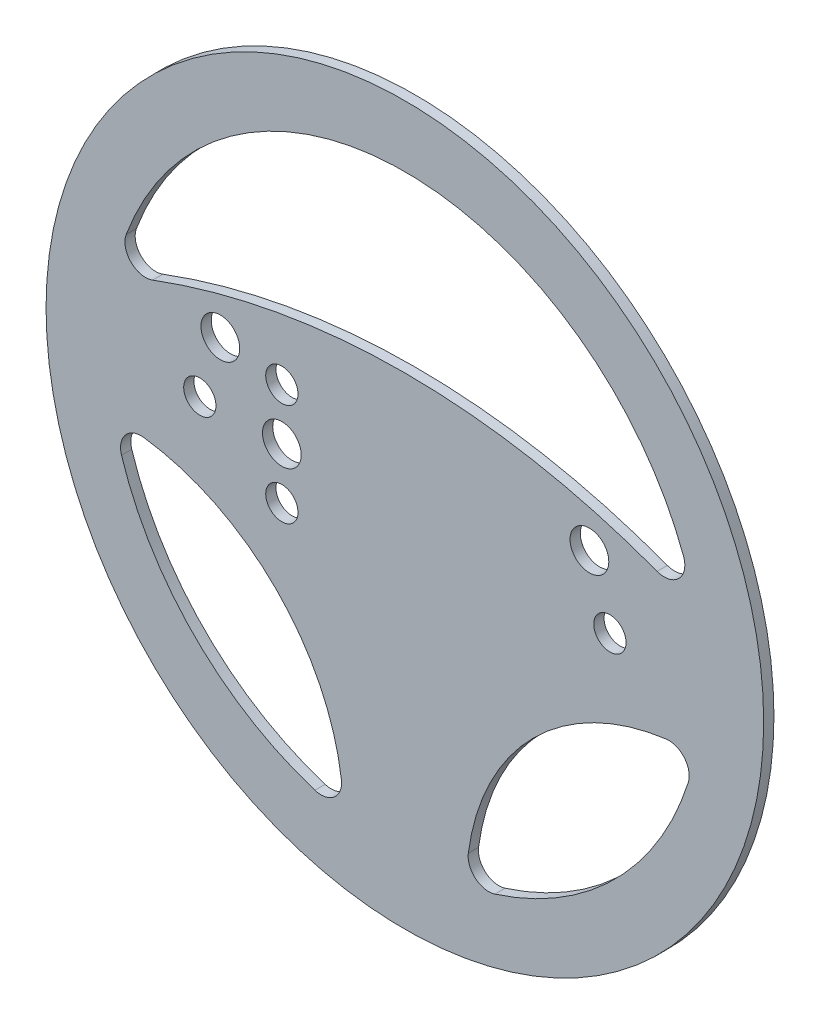
ISO-10303-21;
HEADER;
FILE_DESCRIPTION(('STEP AP214'),'2;1');
FILE_NAME('part.step','',(''),(''),'','','');
FILE_SCHEMA(('AUTOMOTIVE_DESIGN { 1 0 10303 214 1 1 1 1 }'));
ENDSEC;
DATA;
#1=APPLICATION_CONTEXT('core data for automotive mechanical design processes');
#2=APPLICATION_PROTOCOL_DEFINITION('international standard','automotive_design',2000,#1);
#3=PRODUCT_CONTEXT('',#1,'mechanical');
#4=PRODUCT('Part','Part','',(#3));
#5=PRODUCT_RELATED_PRODUCT_CATEGORY('part','',(#4));
#6=PRODUCT_DEFINITION_FORMATION('','',#4);
#7=PRODUCT_DEFINITION_CONTEXT('part definition',#1,'design');
#8=PRODUCT_DEFINITION('design','',#6,#7);
#9=PRODUCT_DEFINITION_SHAPE('','',#8);
#10=(LENGTH_UNIT() NAMED_UNIT(*) SI_UNIT(.MILLI.,.METRE.));
#11=(NAMED_UNIT(*) PLANE_ANGLE_UNIT() SI_UNIT($,.RADIAN.));
#12=(NAMED_UNIT(*) SI_UNIT($,.STERADIAN.) SOLID_ANGLE_UNIT());
#13=UNCERTAINTY_MEASURE_WITH_UNIT(LENGTH_MEASURE(1.E-05),#10,'distance_accuracy_value','');
#14=(GEOMETRIC_REPRESENTATION_CONTEXT(3) GLOBAL_UNCERTAINTY_ASSIGNED_CONTEXT((#13)) GLOBAL_UNIT_ASSIGNED_CONTEXT((#10,
#11,#12)) REPRESENTATION_CONTEXT('',''));
#15=CARTESIAN_POINT('',(0.,0.,0.));
#16=DIRECTION('',(0.,0.,1.));
#17=DIRECTION('',(1.,0.,0.));
#18=AXIS2_PLACEMENT_3D('',#15,#16,#17);
#19=CARTESIAN_POINT('',(0.,0.,3.175));
#20=DIRECTION('',(0.,0.,1.));
#21=DIRECTION('',(1.,0.,0.));
#22=AXIS2_PLACEMENT_3D('',#19,#20,#21);
#23=PLANE('',#22);
#24=CARTESIAN_POINT('',(-38.1,0.,3.175));
#25=DIRECTION('',(0.,0.,1.));
#26=DIRECTION('',(1.,0.,0.));
#27=AXIS2_PLACEMENT_3D('',#24,#25,#26);
#28=CIRCLE('',#27,5.999999938);
#29=CARTESIAN_POINT('',(-32.100000062,0.,3.175));
#30=VERTEX_POINT('',#29);
#31=EDGE_CURVE('E417',#30,#30,#28,.F.);
#32=ORIENTED_EDGE('',*,*,#31,.T.);
#33=EDGE_LOOP('',(#32));
#34=FACE_BOUND('',#33,.T.);
#35=CARTESIAN_POINT('',(-63.5,0.,3.175));
#36=DIRECTION('',(0.,0.,1.));
#37=DIRECTION('',(1.,0.,0.));
#38=AXIS2_PLACEMENT_3D('',#35,#36,#37);
#39=CIRCLE('',#38,5.000000033);
#40=CARTESIAN_POINT('',(-58.499999967,0.,3.175));
#41=VERTEX_POINT('',#40);
#42=EDGE_CURVE('E424',#41,#41,#39,.F.);
#43=ORIENTED_EDGE('',*,*,#42,.T.);
#44=EDGE_LOOP('',(#43));
#45=FACE_BOUND('',#44,.T.);
#46=CARTESIAN_POINT('',(-57.15,19.05,3.175));
#47=DIRECTION('',(0.,0.,1.));
#48=DIRECTION('',(1.,0.,0.));
#49=AXIS2_PLACEMENT_3D('',#46,#47,#48);
#50=CIRCLE('',#49,5.99999993799999);
#51=CARTESIAN_POINT('',(-51.150000062,19.05,3.175));
#52=VERTEX_POINT('',#51);
#53=EDGE_CURVE('E435',#52,#52,#50,.F.);
#54=ORIENTED_EDGE('',*,*,#53,.T.);
#55=EDGE_LOOP('',(#54));
#56=FACE_BOUND('',#55,.T.);
#57=CARTESIAN_POINT('',(63.5,0.,3.175));
#58=DIRECTION('',(0.,0.,1.));
#59=DIRECTION('',(1.,0.,0.));
#60=AXIS2_PLACEMENT_3D('',#57,#58,#59);
#61=CIRCLE('',#60,5.000000033);
#62=CARTESIAN_POINT('',(68.500000033,0.,3.175));
#63=VERTEX_POINT('',#62);
#64=EDGE_CURVE('E434',#63,#63,#61,.F.);
#65=ORIENTED_EDGE('',*,*,#64,.T.);
#66=EDGE_LOOP('',(#65));
#67=FACE_BOUND('',#66,.T.);
#68=CARTESIAN_POINT('',(-38.1,15.875,3.175));
#69=DIRECTION('',(0.,0.,1.));
#70=DIRECTION('',(1.,0.,0.));
#71=AXIS2_PLACEMENT_3D('',#68,#69,#70);
#72=CIRCLE('',#71,5.000000033);
#73=CARTESIAN_POINT('',(-33.099999967,15.875,3.175));
#74=VERTEX_POINT('',#73);
#75=EDGE_CURVE('E426',#74,#74,#72,.F.);
#76=ORIENTED_EDGE('',*,*,#75,.T.);
#77=EDGE_LOOP('',(#76));
#78=FACE_BOUND('',#77,.T.);
#79=CARTESIAN_POINT('',(-38.1,-15.875,3.175));
#80=DIRECTION('',(0.,0.,1.));
#81=DIRECTION('',(1.,0.,0.));
#82=AXIS2_PLACEMENT_3D('',#79,#80,#81);
#83=CIRCLE('',#82,5.000000033);
#84=CARTESIAN_POINT('',(-33.099999967,-15.875,3.175));
#85=VERTEX_POINT('',#84);
#86=EDGE_CURVE('E552',#85,#85,#83,.F.);
#87=ORIENTED_EDGE('',*,*,#86,.T.);
#88=EDGE_LOOP('',(#87));
#89=FACE_BOUND('',#88,.T.);
#90=CARTESIAN_POINT('',(57.15,19.05,3.175));
#91=DIRECTION('',(0.,0.,1.));
#92=DIRECTION('',(1.,0.,0.));
#93=AXIS2_PLACEMENT_3D('',#90,#91,#92);
#94=CIRCLE('',#93,5.99999993799999);
#95=CARTESIAN_POINT('',(63.149999938,19.05,3.175));
#96=VERTEX_POINT('',#95);
#97=EDGE_CURVE('E162',#96,#96,#94,.F.);
#98=ORIENTED_EDGE('',*,*,#97,.T.);
#99=EDGE_LOOP('',(#98));
#100=FACE_BOUND('',#99,.T.);
#101=CARTESIAN_POINT('',(0.,0.,3.175));
#102=DIRECTION('',(0.,0.,1.));
#103=DIRECTION('',(1.,0.,0.));
#104=AXIS2_PLACEMENT_3D('',#101,#102,#103);
#105=CIRCLE('',#104,111.125);
#106=CARTESIAN_POINT('',(111.125,0.,3.175));
#107=VERTEX_POINT('',#106);
#108=EDGE_CURVE('E11',#107,#107,#105,.T.);
#109=ORIENTED_EDGE('',*,*,#108,.T.);
#110=EDGE_LOOP('',(#109));
#111=FACE_BOUND('',#110,.T.);
#112=CARTESIAN_POINT('',(-1.85962356624714E-12,1.88737914186277E-12,3.175));
#113=DIRECTION('',(0.,0.,1.));
#114=DIRECTION('',(1.,0.,0.));
#115=AXIS2_PLACEMENT_3D('',#112,#113,#114);
#116=CIRCLE('',#115,92.0750000000023);
#117=CARTESIAN_POINT('',(27.8667406062713,-87.7567683599549,3.175));
#118=VERTEX_POINT('',#117);
#119=CARTESIAN_POINT('',(87.7567683599549,-27.8667406062714,3.175));
#120=VERTEX_POINT('',#119);
#121=EDGE_CURVE('E224',#118,#120,#116,.T.);
#122=ORIENTED_EDGE('',*,*,#121,.F.);
#123=CARTESIAN_POINT('',(25.9448964265285,-81.7045774385787,3.175));
#124=DIRECTION('',(0.,0.,1.));
#125=DIRECTION('',(-1.,0.,0.));
#126=AXIS2_PLACEMENT_3D('',#123,#124,#125);
#127=CIRCLE('',#126,6.34999999999998);
#128=CARTESIAN_POINT('',(19.6483896983694,-80.8820794007405,3.175));
#129=VERTEX_POINT('',#128);
#130=EDGE_CURVE('E221',#129,#118,#127,.T.);
#131=ORIENTED_EDGE('',*,*,#130,.F.);
#132=CARTESIAN_POINT('',(90.0827570903555,-90.0827570903555,3.175));
#133=DIRECTION('',(0.,0.,1.));
#134=DIRECTION('',(-1.,0.,0.));
#135=AXIS2_PLACEMENT_3D('',#132,#133,#134);
#136=CIRCLE('',#135,71.0327570903555);
#137=CARTESIAN_POINT('',(80.8820794007406,-19.6483896983694,3.175));
#138=VERTEX_POINT('',#137);
#139=EDGE_CURVE('E232',#138,#129,#136,.T.);
#140=ORIENTED_EDGE('',*,*,#139,.F.);
#141=CARTESIAN_POINT('',(81.7045774385787,-25.9448964265285,3.175));
#142=DIRECTION('',(0.,0.,1.));
#143=DIRECTION('',(-1.,0.,0.));
#144=AXIS2_PLACEMENT_3D('',#141,#142,#143);
#145=CIRCLE('',#144,6.34999999999999);
#146=EDGE_CURVE('E228',#120,#138,#145,.T.);
#147=ORIENTED_EDGE('',*,*,#146,.F.);
#148=EDGE_LOOP('',(#122,#131,#140,#147));
#149=FACE_BOUND('',#148,.T.);
#150=CARTESIAN_POINT('',(0.,0.,3.175));
#151=DIRECTION('',(0.,0.,1.));
#152=DIRECTION('',(-1.,0.,0.));
#153=AXIS2_PLACEMENT_3D('',#150,#151,#152);
#154=CIRCLE('',#153,92.075);
#155=CARTESIAN_POINT('',(86.2998340641457,32.0958605664487,3.175));
#156=VERTEX_POINT('',#155);
#157=CARTESIAN_POINT('',(-86.2998340641457,32.0958605664487,3.175));
#158=VERTEX_POINT('',#157);
#159=EDGE_CURVE('E181',#156,#158,#154,.T.);
#160=ORIENTED_EDGE('',*,*,#159,.F.);
#161=CARTESIAN_POINT('',(80.3481213700667,29.8823529411764,3.175));
#162=DIRECTION('',(0.,0.,1.));
#163=DIRECTION('',(1.,0.,0.));
#164=AXIS2_PLACEMENT_3D('',#161,#162,#163);
#165=CIRCLE('',#164,6.35000000000001);
#166=CARTESIAN_POINT('',(78.1188093320533,23.9365419925195,3.175));
#167=VERTEX_POINT('',#166);
#168=EDGE_CURVE('E178',#167,#156,#165,.T.);
#169=ORIENTED_EDGE('',*,*,#168,.F.);
#170=CARTESIAN_POINT('',(0.,-184.414583333333,3.175));
#171=DIRECTION('',(0.,0.,-1.));
#172=DIRECTION('',(-1.,0.,0.));
#173=AXIS2_PLACEMENT_3D('',#170,#171,#172);
#174=CIRCLE('',#173,222.514583333333);
#175=CARTESIAN_POINT('',(-78.1188093320533,23.9365419925195,3.175));
#176=VERTEX_POINT('',#175);
#177=EDGE_CURVE('E189',#176,#167,#174,.T.);
#178=ORIENTED_EDGE('',*,*,#177,.F.);
#179=CARTESIAN_POINT('',(-80.3481213700667,29.8823529411764,3.175));
#180=DIRECTION('',(0.,0.,1.));
#181=DIRECTION('',(-1.,0.,0.));
#182=AXIS2_PLACEMENT_3D('',#179,#180,#181);
#183=CIRCLE('',#182,6.34999999999997);
#184=EDGE_CURVE('E185',#158,#176,#183,.T.);
#185=ORIENTED_EDGE('',*,*,#184,.F.);
#186=EDGE_LOOP('',(#160,#169,#178,#185));
#187=FACE_BOUND('',#186,.T.);
#188=CARTESIAN_POINT('',(-90.0827570903555,-90.0827570903556,3.175));
#189=DIRECTION('',(0.,0.,1.));
#190=DIRECTION('',(1.,0.,0.));
#191=AXIS2_PLACEMENT_3D('',#188,#189,#190);
#192=CIRCLE('',#191,71.0327570903555);
#193=CARTESIAN_POINT('',(-19.6483896983694,-80.8820794007405,3.175));
#194=VERTEX_POINT('',#193);
#195=CARTESIAN_POINT('',(-80.8820794007405,-19.6483896983695,3.175));
#196=VERTEX_POINT('',#195);
#197=EDGE_CURVE('E137',#194,#196,#192,.T.);
#198=ORIENTED_EDGE('',*,*,#197,.F.);
#199=CARTESIAN_POINT('',(-25.9448964265285,-81.7045774385787,3.175));
#200=DIRECTION('',(0.,0.,1.));
#201=DIRECTION('',(1.,0.,0.));
#202=AXIS2_PLACEMENT_3D('',#199,#200,#201);
#203=CIRCLE('',#202,6.35000000000001);
#204=CARTESIAN_POINT('',(-27.8667406062714,-87.7567683599549,3.175));
#205=VERTEX_POINT('',#204);
#206=EDGE_CURVE('E128',#205,#194,#203,.T.);
#207=ORIENTED_EDGE('',*,*,#206,.F.);
#208=CARTESIAN_POINT('',(2.42861286636753E-13,2.63677968348475E-13,3.175));
#209=DIRECTION('',(0.,0.,1.));
#210=DIRECTION('',(1.,0.,0.));
#211=AXIS2_PLACEMENT_3D('',#208,#209,#210);
#212=CIRCLE('',#211,92.0750000000003);
#213=CARTESIAN_POINT('',(-87.7567683599549,-27.8667406062714,3.175));
#214=VERTEX_POINT('',#213);
#215=EDGE_CURVE('E154',#214,#205,#212,.T.);
#216=ORIENTED_EDGE('',*,*,#215,.F.);
#217=CARTESIAN_POINT('',(-81.7045774385787,-25.9448964265285,3.175));
#218=DIRECTION('',(0.,0.,1.));
#219=DIRECTION('',(-1.,0.,0.));
#220=AXIS2_PLACEMENT_3D('',#217,#218,#219);
#221=CIRCLE('',#220,6.34999999999999);
#222=EDGE_CURVE('E150',#196,#214,#221,.T.);
#223=ORIENTED_EDGE('',*,*,#222,.F.);
#224=EDGE_LOOP('',(#198,#207,#216,#223));
#225=FACE_BOUND('',#224,.T.);
#226=ADVANCED_FACE('F38',(#34,#45,#56,#67,#78,#89,#100,#111,#149,#187,#225),#23,.T.);
#227=CARTESIAN_POINT('',(0.,0.,0.));
#228=DIRECTION('',(0.,0.,1.));
#229=DIRECTION('',(1.,0.,0.));
#230=AXIS2_PLACEMENT_3D('',#227,#228,#229);
#231=PLANE('',#230);
#232=CARTESIAN_POINT('',(-38.1,0.,0.));
#233=DIRECTION('',(0.,0.,-1.));
#234=DIRECTION('',(-1.,0.,0.));
#235=AXIS2_PLACEMENT_3D('',#232,#233,#234);
#236=CIRCLE('',#235,5.999999938);
#237=CARTESIAN_POINT('',(-44.099999938,0.,0.));
#238=VERTEX_POINT('',#237);
#239=EDGE_CURVE('E415',#238,#238,#236,.T.);
#240=ORIENTED_EDGE('',*,*,#239,.F.);
#241=EDGE_LOOP('',(#240));
#242=FACE_BOUND('',#241,.T.);
#243=CARTESIAN_POINT('',(-63.5,0.,0.));
#244=DIRECTION('',(0.,0.,-1.));
#245=DIRECTION('',(1.,0.,0.));
#246=AXIS2_PLACEMENT_3D('',#243,#244,#245);
#247=CIRCLE('',#246,5.000000033);
#248=CARTESIAN_POINT('',(-58.499999967,0.,0.));
#249=VERTEX_POINT('',#248);
#250=EDGE_CURVE('E419',#249,#249,#247,.T.);
#251=ORIENTED_EDGE('',*,*,#250,.F.);
#252=EDGE_LOOP('',(#251));
#253=FACE_BOUND('',#252,.T.);
#254=CARTESIAN_POINT('',(-57.15,19.05,0.));
#255=DIRECTION('',(0.,0.,-1.));
#256=DIRECTION('',(1.,0.,0.));
#257=AXIS2_PLACEMENT_3D('',#254,#255,#256);
#258=CIRCLE('',#257,5.99999993799999);
#259=CARTESIAN_POINT('',(-51.150000062,19.05,0.));
#260=VERTEX_POINT('',#259);
#261=EDGE_CURVE('E440',#260,#260,#258,.T.);
#262=ORIENTED_EDGE('',*,*,#261,.F.);
#263=EDGE_LOOP('',(#262));
#264=FACE_BOUND('',#263,.T.);
#265=CARTESIAN_POINT('',(63.5,0.,0.));
#266=DIRECTION('',(0.,0.,-1.));
#267=DIRECTION('',(-1.,0.,0.));
#268=AXIS2_PLACEMENT_3D('',#265,#266,#267);
#269=CIRCLE('',#268,5.000000033);
#270=CARTESIAN_POINT('',(58.499999967,0.,0.));
#271=VERTEX_POINT('',#270);
#272=EDGE_CURVE('E430',#271,#271,#269,.T.);
#273=ORIENTED_EDGE('',*,*,#272,.F.);
#274=EDGE_LOOP('',(#273));
#275=FACE_BOUND('',#274,.T.);
#276=CARTESIAN_POINT('',(-38.1,15.875,0.));
#277=DIRECTION('',(0.,0.,-1.));
#278=DIRECTION('',(-1.,0.,0.));
#279=AXIS2_PLACEMENT_3D('',#276,#277,#278);
#280=CIRCLE('',#279,5.000000033);
#281=CARTESIAN_POINT('',(-43.100000033,15.875,0.));
#282=VERTEX_POINT('',#281);
#283=EDGE_CURVE('E556',#282,#282,#280,.T.);
#284=ORIENTED_EDGE('',*,*,#283,.F.);
#285=EDGE_LOOP('',(#284));
#286=FACE_BOUND('',#285,.T.);
#287=CARTESIAN_POINT('',(-38.1,-15.875,0.));
#288=DIRECTION('',(0.,0.,-1.));
#289=DIRECTION('',(-1.,0.,0.));
#290=AXIS2_PLACEMENT_3D('',#287,#288,#289);
#291=CIRCLE('',#290,5.000000033);
#292=CARTESIAN_POINT('',(-43.100000033,-15.875,0.));
#293=VERTEX_POINT('',#292);
#294=EDGE_CURVE('E557',#293,#293,#291,.T.);
#295=ORIENTED_EDGE('',*,*,#294,.F.);
#296=EDGE_LOOP('',(#295));
#297=FACE_BOUND('',#296,.T.);
#298=CARTESIAN_POINT('',(57.15,19.05,0.));
#299=DIRECTION('',(0.,0.,-1.));
#300=DIRECTION('',(-1.,0.,0.));
#301=AXIS2_PLACEMENT_3D('',#298,#299,#300);
#302=CIRCLE('',#301,5.99999993799999);
#303=CARTESIAN_POINT('',(51.150000062,19.05,0.));
#304=VERTEX_POINT('',#303);
#305=EDGE_CURVE('E439',#304,#304,#302,.T.);
#306=ORIENTED_EDGE('',*,*,#305,.F.);
#307=EDGE_LOOP('',(#306));
#308=FACE_BOUND('',#307,.T.);
#309=CARTESIAN_POINT('',(80.3481213700667,29.8823529411764,0.));
#310=DIRECTION('',(0.,0.,1.));
#311=DIRECTION('',(1.,0.,0.));
#312=AXIS2_PLACEMENT_3D('',#309,#310,#311);
#313=CIRCLE('',#312,6.35000000000001);
#314=CARTESIAN_POINT('',(78.1188093320533,23.9365419925195,0.));
#315=VERTEX_POINT('',#314);
#316=CARTESIAN_POINT('',(86.2998340641457,32.0958605664487,0.));
#317=VERTEX_POINT('',#316);
#318=EDGE_CURVE('E146',#315,#317,#313,.T.);
#319=ORIENTED_EDGE('',*,*,#318,.T.);
#320=CARTESIAN_POINT('',(0.,0.,0.));
#321=DIRECTION('',(0.,0.,1.));
#322=DIRECTION('',(-1.,0.,0.));
#323=AXIS2_PLACEMENT_3D('',#320,#321,#322);
#324=CIRCLE('',#323,92.075);
#325=CARTESIAN_POINT('',(-86.2998340641457,32.0958605664487,0.));
#326=VERTEX_POINT('',#325);
#327=EDGE_CURVE('E196',#317,#326,#324,.T.);
#328=ORIENTED_EDGE('',*,*,#327,.T.);
#329=CARTESIAN_POINT('',(-80.3481213700667,29.8823529411764,0.));
#330=DIRECTION('',(0.,0.,1.));
#331=DIRECTION('',(-1.,0.,0.));
#332=AXIS2_PLACEMENT_3D('',#329,#330,#331);
#333=CIRCLE('',#332,6.34999999999997);
#334=CARTESIAN_POINT('',(-78.1188093320533,23.9365419925195,0.));
#335=VERTEX_POINT('',#334);
#336=EDGE_CURVE('E200',#326,#335,#333,.T.);
#337=ORIENTED_EDGE('',*,*,#336,.T.);
#338=CARTESIAN_POINT('',(0.,-184.414583333333,0.));
#339=DIRECTION('',(0.,0.,-1.));
#340=DIRECTION('',(-1.,0.,0.));
#341=AXIS2_PLACEMENT_3D('',#338,#339,#340);
#342=CIRCLE('',#341,222.514583333333);
#343=EDGE_CURVE('E182',#335,#315,#342,.T.);
#344=ORIENTED_EDGE('',*,*,#343,.T.);
#345=EDGE_LOOP('',(#319,#328,#337,#344));
#346=FACE_BOUND('',#345,.T.);
#347=CARTESIAN_POINT('',(0.,0.,0.));
#348=DIRECTION('',(0.,0.,1.));
#349=DIRECTION('',(1.,0.,0.));
#350=AXIS2_PLACEMENT_3D('',#347,#348,#349);
#351=CIRCLE('',#350,111.125);
#352=CARTESIAN_POINT('',(111.125,0.,0.));
#353=VERTEX_POINT('',#352);
#354=EDGE_CURVE('E42',#353,#353,#351,.T.);
#355=ORIENTED_EDGE('',*,*,#354,.F.);
#356=EDGE_LOOP('',(#355));
#357=FACE_BOUND('',#356,.T.);
#358=CARTESIAN_POINT('',(25.9448964265285,-81.7045774385787,0.));
#359=DIRECTION('',(0.,0.,1.));
#360=DIRECTION('',(-1.,0.,0.));
#361=AXIS2_PLACEMENT_3D('',#358,#359,#360);
#362=CIRCLE('',#361,6.34999999999998);
#363=CARTESIAN_POINT('',(19.6483896983694,-80.8820794007405,0.));
#364=VERTEX_POINT('',#363);
#365=CARTESIAN_POINT('',(27.8667406062713,-87.7567683599549,0.));
#366=VERTEX_POINT('',#365);
#367=EDGE_CURVE('E220',#364,#366,#362,.T.);
#368=ORIENTED_EDGE('',*,*,#367,.T.);
#369=CARTESIAN_POINT('',(-1.85962356624714E-12,1.88737914186277E-12,0.));
#370=DIRECTION('',(0.,0.,1.));
#371=DIRECTION('',(1.,0.,0.));
#372=AXIS2_PLACEMENT_3D('',#369,#370,#371);
#373=CIRCLE('',#372,92.0750000000023);
#374=CARTESIAN_POINT('',(87.7567683599549,-27.8667406062714,0.));
#375=VERTEX_POINT('',#374);
#376=EDGE_CURVE('E239',#366,#375,#373,.T.);
#377=ORIENTED_EDGE('',*,*,#376,.T.);
#378=CARTESIAN_POINT('',(81.7045774385787,-25.9448964265285,0.));
#379=DIRECTION('',(0.,0.,1.));
#380=DIRECTION('',(-1.,0.,0.));
#381=AXIS2_PLACEMENT_3D('',#378,#379,#380);
#382=CIRCLE('',#381,6.34999999999999);
#383=CARTESIAN_POINT('',(80.8820794007406,-19.6483896983694,0.));
#384=VERTEX_POINT('',#383);
#385=EDGE_CURVE('E243',#375,#384,#382,.T.);
#386=ORIENTED_EDGE('',*,*,#385,.T.);
#387=CARTESIAN_POINT('',(90.0827570903555,-90.0827570903555,0.));
#388=DIRECTION('',(0.,0.,1.));
#389=DIRECTION('',(-1.,0.,0.));
#390=AXIS2_PLACEMENT_3D('',#387,#388,#389);
#391=CIRCLE('',#390,71.0327570903555);
#392=EDGE_CURVE('E225',#384,#364,#391,.T.);
#393=ORIENTED_EDGE('',*,*,#392,.T.);
#394=EDGE_LOOP('',(#368,#377,#386,#393));
#395=FACE_BOUND('',#394,.T.);
#396=CARTESIAN_POINT('',(-25.9448964265285,-81.7045774385787,0.));
#397=DIRECTION('',(0.,0.,1.));
#398=DIRECTION('',(1.,0.,0.));
#399=AXIS2_PLACEMENT_3D('',#396,#397,#398);
#400=CIRCLE('',#399,6.35000000000001);
#401=CARTESIAN_POINT('',(-27.8667406062714,-87.7567683599549,0.));
#402=VERTEX_POINT('',#401);
#403=CARTESIAN_POINT('',(-19.6483896983694,-80.8820794007405,0.));
#404=VERTEX_POINT('',#403);
#405=EDGE_CURVE('E62',#402,#404,#400,.T.);
#406=ORIENTED_EDGE('',*,*,#405,.T.);
#407=CARTESIAN_POINT('',(-90.0827570903555,-90.0827570903556,0.));
#408=DIRECTION('',(0.,0.,1.));
#409=DIRECTION('',(1.,0.,0.));
#410=AXIS2_PLACEMENT_3D('',#407,#408,#409);
#411=CIRCLE('',#410,71.0327570903555);
#412=CARTESIAN_POINT('',(-80.8820794007405,-19.6483896983695,0.));
#413=VERTEX_POINT('',#412);
#414=EDGE_CURVE('E144',#404,#413,#411,.T.);
#415=ORIENTED_EDGE('',*,*,#414,.T.);
#416=CARTESIAN_POINT('',(-81.7045774385787,-25.9448964265285,0.));
#417=DIRECTION('',(0.,0.,1.));
#418=DIRECTION('',(-1.,0.,0.));
#419=AXIS2_PLACEMENT_3D('',#416,#417,#418);
#420=CIRCLE('',#419,6.34999999999999);
#421=CARTESIAN_POINT('',(-87.7567683599549,-27.8667406062714,0.));
#422=VERTEX_POINT('',#421);
#423=EDGE_CURVE('E165',#413,#422,#420,.T.);
#424=ORIENTED_EDGE('',*,*,#423,.T.);
#425=CARTESIAN_POINT('',(2.42861286636753E-13,2.63677968348475E-13,0.));
#426=DIRECTION('',(0.,0.,1.));
#427=DIRECTION('',(1.,0.,0.));
#428=AXIS2_PLACEMENT_3D('',#425,#426,#427);
#429=CIRCLE('',#428,92.0750000000003);
#430=EDGE_CURVE('E138',#422,#402,#429,.T.);
#431=ORIENTED_EDGE('',*,*,#430,.T.);
#432=EDGE_LOOP('',(#406,#415,#424,#431));
#433=FACE_BOUND('',#432,.T.);
#434=ADVANCED_FACE('F269',(#242,#253,#264,#275,#286,#297,#308,#346,#357,#395,#433),#231,.F.);
#435=CARTESIAN_POINT('',(0.,0.,3.175));
#436=DIRECTION('',(0.,0.,-1.));
#437=DIRECTION('',(-1.,0.,0.));
#438=AXIS2_PLACEMENT_3D('',#435,#436,#437);
#439=CYLINDRICAL_SURFACE('',#438,111.125);
#440=ORIENTED_EDGE('',*,*,#108,.F.);
#441=EDGE_LOOP('',(#440));
#442=FACE_BOUND('',#441,.T.);
#443=ORIENTED_EDGE('',*,*,#354,.T.);
#444=EDGE_LOOP('',(#443));
#445=FACE_BOUND('',#444,.T.);
#446=ADVANCED_FACE('F40',(#442,#445),#439,.T.);
#447=CARTESIAN_POINT('',(25.9448964265285,-81.7045774385787,3.175));
#448=DIRECTION('',(0.,0.,-1.));
#449=DIRECTION('',(-1.,0.,0.));
#450=AXIS2_PLACEMENT_3D('',#447,#448,#449);
#451=CYLINDRICAL_SURFACE('',#450,6.34999999999998);
#452=ORIENTED_EDGE('',*,*,#367,.F.);
#453=DIRECTION('',(0.,0.,-1.));
#454=VECTOR('',#453,1.);
#455=CARTESIAN_POINT('',(19.6483896983694,-80.8820794007405,3.175));
#456=LINE('',#455,#454);
#457=EDGE_CURVE('E235',#129,#364,#456,.T.);
#458=ORIENTED_EDGE('',*,*,#457,.F.);
#459=ORIENTED_EDGE('',*,*,#130,.T.);
#460=DIRECTION('',(0.,0.,-1.));
#461=VECTOR('',#460,1.);
#462=CARTESIAN_POINT('',(27.8667406062713,-87.7567683599549,3.175));
#463=LINE('',#462,#461);
#464=EDGE_CURVE('E259',#118,#366,#463,.T.);
#465=ORIENTED_EDGE('',*,*,#464,.T.);
#466=EDGE_LOOP('',(#452,#458,#459,#465));
#467=FACE_BOUND('',#466,.T.);
#468=ADVANCED_FACE('F297',(#467),#451,.F.);
#469=CARTESIAN_POINT('',(-1.85962356624714E-12,1.88737914186277E-12,3.175));
#470=DIRECTION('',(0.,0.,-1.));
#471=DIRECTION('',(-1.,0.,0.));
#472=AXIS2_PLACEMENT_3D('',#469,#470,#471);
#473=CYLINDRICAL_SURFACE('',#472,92.0750000000023);
#474=ORIENTED_EDGE('',*,*,#376,.F.);
#475=ORIENTED_EDGE('',*,*,#464,.F.);
#476=ORIENTED_EDGE('',*,*,#121,.T.);
#477=DIRECTION('',(0.,0.,-1.));
#478=VECTOR('',#477,1.);
#479=CARTESIAN_POINT('',(87.7567683599549,-27.8667406062714,3.175));
#480=LINE('',#479,#478);
#481=EDGE_CURVE('E256',#120,#375,#480,.T.);
#482=ORIENTED_EDGE('',*,*,#481,.T.);
#483=EDGE_LOOP('',(#474,#475,#476,#482));
#484=FACE_BOUND('',#483,.T.);
#485=ADVANCED_FACE('F300',(#484),#473,.F.);
#486=CARTESIAN_POINT('',(81.7045774385787,-25.9448964265285,3.175));
#487=DIRECTION('',(0.,0.,-1.));
#488=DIRECTION('',(-1.,0.,0.));
#489=AXIS2_PLACEMENT_3D('',#486,#487,#488);
#490=CYLINDRICAL_SURFACE('',#489,6.34999999999999);
#491=ORIENTED_EDGE('',*,*,#385,.F.);
#492=ORIENTED_EDGE('',*,*,#481,.F.);
#493=ORIENTED_EDGE('',*,*,#146,.T.);
#494=DIRECTION('',(0.,0.,-1.));
#495=VECTOR('',#494,1.);
#496=CARTESIAN_POINT('',(80.8820794007406,-19.6483896983694,3.175));
#497=LINE('',#496,#495);
#498=EDGE_CURVE('E253',#138,#384,#497,.T.);
#499=ORIENTED_EDGE('',*,*,#498,.T.);
#500=EDGE_LOOP('',(#491,#492,#493,#499));
#501=FACE_BOUND('',#500,.T.);
#502=ADVANCED_FACE('F303',(#501),#490,.F.);
#503=CARTESIAN_POINT('',(90.0827570903555,-90.0827570903555,3.175));
#504=DIRECTION('',(0.,0.,-1.));
#505=DIRECTION('',(-1.,0.,0.));
#506=AXIS2_PLACEMENT_3D('',#503,#504,#505);
#507=CYLINDRICAL_SURFACE('',#506,71.0327570903555);
#508=ORIENTED_EDGE('',*,*,#392,.F.);
#509=ORIENTED_EDGE('',*,*,#498,.F.);
#510=ORIENTED_EDGE('',*,*,#139,.T.);
#511=ORIENTED_EDGE('',*,*,#457,.T.);
#512=EDGE_LOOP('',(#508,#509,#510,#511));
#513=FACE_BOUND('',#512,.T.);
#514=ADVANCED_FACE('F307',(#513),#507,.F.);
#515=CARTESIAN_POINT('',(80.3481213700667,29.8823529411764,3.175));
#516=DIRECTION('',(0.,0.,-1.));
#517=DIRECTION('',(-1.,0.,0.));
#518=AXIS2_PLACEMENT_3D('',#515,#516,#517);
#519=CYLINDRICAL_SURFACE('',#518,6.35000000000001);
#520=ORIENTED_EDGE('',*,*,#318,.F.);
#521=DIRECTION('',(0.,0.,-1.));
#522=VECTOR('',#521,1.);
#523=CARTESIAN_POINT('',(78.1188093320533,23.9365419925195,3.175));
#524=LINE('',#523,#522);
#525=EDGE_CURVE('E192',#167,#315,#524,.T.);
#526=ORIENTED_EDGE('',*,*,#525,.F.);
#527=ORIENTED_EDGE('',*,*,#168,.T.);
#528=DIRECTION('',(0.,0.,-1.));
#529=VECTOR('',#528,1.);
#530=CARTESIAN_POINT('',(86.2998340641457,32.0958605664487,3.175));
#531=LINE('',#530,#529);
#532=EDGE_CURVE('E216',#156,#317,#531,.T.);
#533=ORIENTED_EDGE('',*,*,#532,.T.);
#534=EDGE_LOOP('',(#520,#526,#527,#533));
#535=FACE_BOUND('',#534,.T.);
#536=ADVANCED_FACE('F311',(#535),#519,.F.);
#537=CARTESIAN_POINT('',(0.,0.,3.175));
#538=DIRECTION('',(0.,0.,-1.));
#539=DIRECTION('',(-1.,0.,0.));
#540=AXIS2_PLACEMENT_3D('',#537,#538,#539);
#541=CYLINDRICAL_SURFACE('',#540,92.075);
#542=ORIENTED_EDGE('',*,*,#327,.F.);
#543=ORIENTED_EDGE('',*,*,#532,.F.);
#544=ORIENTED_EDGE('',*,*,#159,.T.);
#545=DIRECTION('',(0.,0.,-1.));
#546=VECTOR('',#545,1.);
#547=CARTESIAN_POINT('',(-86.2998340641457,32.0958605664487,3.175));
#548=LINE('',#547,#546);
#549=EDGE_CURVE('E213',#158,#326,#548,.T.);
#550=ORIENTED_EDGE('',*,*,#549,.T.);
#551=EDGE_LOOP('',(#542,#543,#544,#550));
#552=FACE_BOUND('',#551,.T.);
#553=ADVANCED_FACE('F315',(#552),#541,.F.);
#554=CARTESIAN_POINT('',(-80.3481213700667,29.8823529411764,3.175));
#555=DIRECTION('',(0.,0.,-1.));
#556=DIRECTION('',(-1.,0.,0.));
#557=AXIS2_PLACEMENT_3D('',#554,#555,#556);
#558=CYLINDRICAL_SURFACE('',#557,6.34999999999997);
#559=ORIENTED_EDGE('',*,*,#336,.F.);
#560=ORIENTED_EDGE('',*,*,#549,.F.);
#561=ORIENTED_EDGE('',*,*,#184,.T.);
#562=DIRECTION('',(0.,0.,-1.));
#563=VECTOR('',#562,1.);
#564=CARTESIAN_POINT('',(-78.1188093320533,23.9365419925195,3.175));
#565=LINE('',#564,#563);
#566=EDGE_CURVE('E210',#176,#335,#565,.T.);
#567=ORIENTED_EDGE('',*,*,#566,.T.);
#568=EDGE_LOOP('',(#559,#560,#561,#567));
#569=FACE_BOUND('',#568,.T.);
#570=ADVANCED_FACE('F319',(#569),#558,.F.);
#571=CARTESIAN_POINT('',(0.,-184.414583333333,3.175));
#572=DIRECTION('',(0.,0.,-1.));
#573=DIRECTION('',(-1.,0.,0.));
#574=AXIS2_PLACEMENT_3D('',#571,#572,#573);
#575=CYLINDRICAL_SURFACE('',#574,222.514583333333);
#576=ORIENTED_EDGE('',*,*,#343,.F.);
#577=ORIENTED_EDGE('',*,*,#566,.F.);
#578=ORIENTED_EDGE('',*,*,#177,.T.);
#579=ORIENTED_EDGE('',*,*,#525,.T.);
#580=EDGE_LOOP('',(#576,#577,#578,#579));
#581=FACE_BOUND('',#580,.T.);
#582=ADVANCED_FACE('F323',(#581),#575,.T.);
#583=CARTESIAN_POINT('',(-25.9448964265285,-81.7045774385787,3.175));
#584=DIRECTION('',(0.,0.,-1.));
#585=DIRECTION('',(-1.,0.,0.));
#586=AXIS2_PLACEMENT_3D('',#583,#584,#585);
#587=CYLINDRICAL_SURFACE('',#586,6.35000000000001);
#588=ORIENTED_EDGE('',*,*,#405,.F.);
#589=DIRECTION('',(0.,0.,-1.));
#590=VECTOR('',#589,1.);
#591=CARTESIAN_POINT('',(-27.8667406062714,-87.7567683599549,3.175));
#592=LINE('',#591,#590);
#593=EDGE_CURVE('E132',#205,#402,#592,.T.);
#594=ORIENTED_EDGE('',*,*,#593,.F.);
#595=ORIENTED_EDGE('',*,*,#206,.T.);
#596=DIRECTION('',(0.,0.,-1.));
#597=VECTOR('',#596,1.);
#598=CARTESIAN_POINT('',(-19.6483896983694,-80.8820794007405,3.175));
#599=LINE('',#598,#597);
#600=EDGE_CURVE('E131',#194,#404,#599,.T.);
#601=ORIENTED_EDGE('',*,*,#600,.T.);
#602=EDGE_LOOP('',(#588,#594,#595,#601));
#603=FACE_BOUND('',#602,.T.);
#604=ADVANCED_FACE('F130',(#603),#587,.F.);
#605=CARTESIAN_POINT('',(-90.0827570903555,-90.0827570903556,3.175));
#606=DIRECTION('',(0.,0.,-1.));
#607=DIRECTION('',(-1.,0.,0.));
#608=AXIS2_PLACEMENT_3D('',#605,#606,#607);
#609=CYLINDRICAL_SURFACE('',#608,71.0327570903555);
#610=ORIENTED_EDGE('',*,*,#414,.F.);
#611=ORIENTED_EDGE('',*,*,#600,.F.);
#612=ORIENTED_EDGE('',*,*,#197,.T.);
#613=DIRECTION('',(0.,0.,-1.));
#614=VECTOR('',#613,1.);
#615=CARTESIAN_POINT('',(-80.8820794007405,-19.6483896983695,3.175));
#616=LINE('',#615,#614);
#617=EDGE_CURVE('E147',#196,#413,#616,.T.);
#618=ORIENTED_EDGE('',*,*,#617,.T.);
#619=EDGE_LOOP('',(#610,#611,#612,#618));
#620=FACE_BOUND('',#619,.T.);
#621=ADVANCED_FACE('F141',(#620),#609,.F.);
#622=CARTESIAN_POINT('',(-81.7045774385787,-25.9448964265285,3.175));
#623=DIRECTION('',(0.,0.,-1.));
#624=DIRECTION('',(-1.,0.,0.));
#625=AXIS2_PLACEMENT_3D('',#622,#623,#624);
#626=CYLINDRICAL_SURFACE('',#625,6.34999999999999);
#627=ORIENTED_EDGE('',*,*,#423,.F.);
#628=ORIENTED_EDGE('',*,*,#617,.F.);
#629=ORIENTED_EDGE('',*,*,#222,.T.);
#630=DIRECTION('',(0.,0.,-1.));
#631=VECTOR('',#630,1.);
#632=CARTESIAN_POINT('',(-87.7567683599549,-27.8667406062714,3.175));
#633=LINE('',#632,#631);
#634=EDGE_CURVE('E54',#214,#422,#633,.T.);
#635=ORIENTED_EDGE('',*,*,#634,.T.);
#636=EDGE_LOOP('',(#627,#628,#629,#635));
#637=FACE_BOUND('',#636,.T.);
#638=ADVANCED_FACE('F278',(#637),#626,.F.);
#639=CARTESIAN_POINT('',(2.42861286636753E-13,2.63677968348475E-13,3.175));
#640=DIRECTION('',(0.,0.,-1.));
#641=DIRECTION('',(-1.,0.,0.));
#642=AXIS2_PLACEMENT_3D('',#639,#640,#641);
#643=CYLINDRICAL_SURFACE('',#642,92.0750000000003);
#644=ORIENTED_EDGE('',*,*,#430,.F.);
#645=ORIENTED_EDGE('',*,*,#634,.F.);
#646=ORIENTED_EDGE('',*,*,#215,.T.);
#647=ORIENTED_EDGE('',*,*,#593,.T.);
#648=EDGE_LOOP('',(#644,#645,#646,#647));
#649=FACE_BOUND('',#648,.T.);
#650=ADVANCED_FACE('F275',(#649),#643,.F.);
#651=CARTESIAN_POINT('',(57.15,19.05,20.1455625731147));
#652=DIRECTION('',(0.,0.,-1.));
#653=DIRECTION('',(-1.,0.,0.));
#654=AXIS2_PLACEMENT_3D('',#651,#652,#653);
#655=CYLINDRICAL_SURFACE('',#654,5.99999993799999);
#656=ORIENTED_EDGE('',*,*,#305,.T.);
#657=EDGE_LOOP('',(#656));
#658=FACE_BOUND('',#657,.T.);
#659=ORIENTED_EDGE('',*,*,#97,.F.);
#660=EDGE_LOOP('',(#659));
#661=FACE_BOUND('',#660,.T.);
#662=ADVANCED_FACE('F277',(#658,#661),#655,.F.);
#663=CARTESIAN_POINT('',(-38.1,-15.875,20.1455625731147));
#664=DIRECTION('',(0.,0.,-1.));
#665=DIRECTION('',(-1.,0.,0.));
#666=AXIS2_PLACEMENT_3D('',#663,#664,#665);
#667=CYLINDRICAL_SURFACE('',#666,5.000000033);
#668=ORIENTED_EDGE('',*,*,#294,.T.);
#669=EDGE_LOOP('',(#668));
#670=FACE_BOUND('',#669,.T.);
#671=ORIENTED_EDGE('',*,*,#86,.F.);
#672=EDGE_LOOP('',(#671));
#673=FACE_BOUND('',#672,.T.);
#674=ADVANCED_FACE('F284',(#670,#673),#667,.F.);
#675=CARTESIAN_POINT('',(-38.1,15.875,20.1455625731147));
#676=DIRECTION('',(0.,0.,-1.));
#677=DIRECTION('',(-1.,0.,0.));
#678=AXIS2_PLACEMENT_3D('',#675,#676,#677);
#679=CYLINDRICAL_SURFACE('',#678,5.000000033);
#680=ORIENTED_EDGE('',*,*,#283,.T.);
#681=EDGE_LOOP('',(#680));
#682=FACE_BOUND('',#681,.T.);
#683=ORIENTED_EDGE('',*,*,#75,.F.);
#684=EDGE_LOOP('',(#683));
#685=FACE_BOUND('',#684,.T.);
#686=ADVANCED_FACE('F358',(#682,#685),#679,.F.);
#687=CARTESIAN_POINT('',(63.5,0.,20.1455625731147));
#688=DIRECTION('',(0.,0.,-1.));
#689=DIRECTION('',(-1.,0.,0.));
#690=AXIS2_PLACEMENT_3D('',#687,#688,#689);
#691=CYLINDRICAL_SURFACE('',#690,5.000000033);
#692=ORIENTED_EDGE('',*,*,#272,.T.);
#693=EDGE_LOOP('',(#692));
#694=FACE_BOUND('',#693,.T.);
#695=ORIENTED_EDGE('',*,*,#64,.F.);
#696=EDGE_LOOP('',(#695));
#697=FACE_BOUND('',#696,.T.);
#698=ADVANCED_FACE('F367',(#694,#697),#691,.F.);
#699=CARTESIAN_POINT('',(-57.15,19.05,20.1455625731147));
#700=DIRECTION('',(0.,0.,-1.));
#701=DIRECTION('',(-1.,0.,0.));
#702=AXIS2_PLACEMENT_3D('',#699,#700,#701);
#703=CYLINDRICAL_SURFACE('',#702,5.99999993799999);
#704=ORIENTED_EDGE('',*,*,#261,.T.);
#705=EDGE_LOOP('',(#704));
#706=FACE_BOUND('',#705,.T.);
#707=ORIENTED_EDGE('',*,*,#53,.F.);
#708=EDGE_LOOP('',(#707));
#709=FACE_BOUND('',#708,.T.);
#710=ADVANCED_FACE('F376',(#706,#709),#703,.F.);
#711=CARTESIAN_POINT('',(-63.5,0.,20.1455625731147));
#712=DIRECTION('',(0.,0.,-1.));
#713=DIRECTION('',(-1.,0.,0.));
#714=AXIS2_PLACEMENT_3D('',#711,#712,#713);
#715=CYLINDRICAL_SURFACE('',#714,5.000000033);
#716=ORIENTED_EDGE('',*,*,#250,.T.);
#717=EDGE_LOOP('',(#716));
#718=FACE_BOUND('',#717,.T.);
#719=ORIENTED_EDGE('',*,*,#42,.F.);
#720=EDGE_LOOP('',(#719));
#721=FACE_BOUND('',#720,.T.);
#722=ADVANCED_FACE('F385',(#718,#721),#715,.F.);
#723=CARTESIAN_POINT('',(-38.1,0.,20.1455625731147));
#724=DIRECTION('',(0.,0.,-1.));
#725=DIRECTION('',(-1.,0.,0.));
#726=AXIS2_PLACEMENT_3D('',#723,#724,#725);
#727=CYLINDRICAL_SURFACE('',#726,5.999999938);
#728=ORIENTED_EDGE('',*,*,#239,.T.);
#729=EDGE_LOOP('',(#728));
#730=FACE_BOUND('',#729,.T.);
#731=ORIENTED_EDGE('',*,*,#31,.F.);
#732=EDGE_LOOP('',(#731));
#733=FACE_BOUND('',#732,.T.);
#734=ADVANCED_FACE('F394',(#730,#733),#727,.F.);
#735=CLOSED_SHELL('',(#226,#434,#446,#468,#485,#502,#514,#536,#553,#570,#582,#604,#621,#638,
#650,#662,#674,#686,#698,#710,#722,#734));
#736=MANIFOLD_SOLID_BREP('B2',#735);
#737=ADVANCED_BREP_SHAPE_REPRESENTATION('',(#18,#736),#14);
#738=SHAPE_DEFINITION_REPRESENTATION(#9,#737);
ENDSEC;
END-ISO-10303-21;
